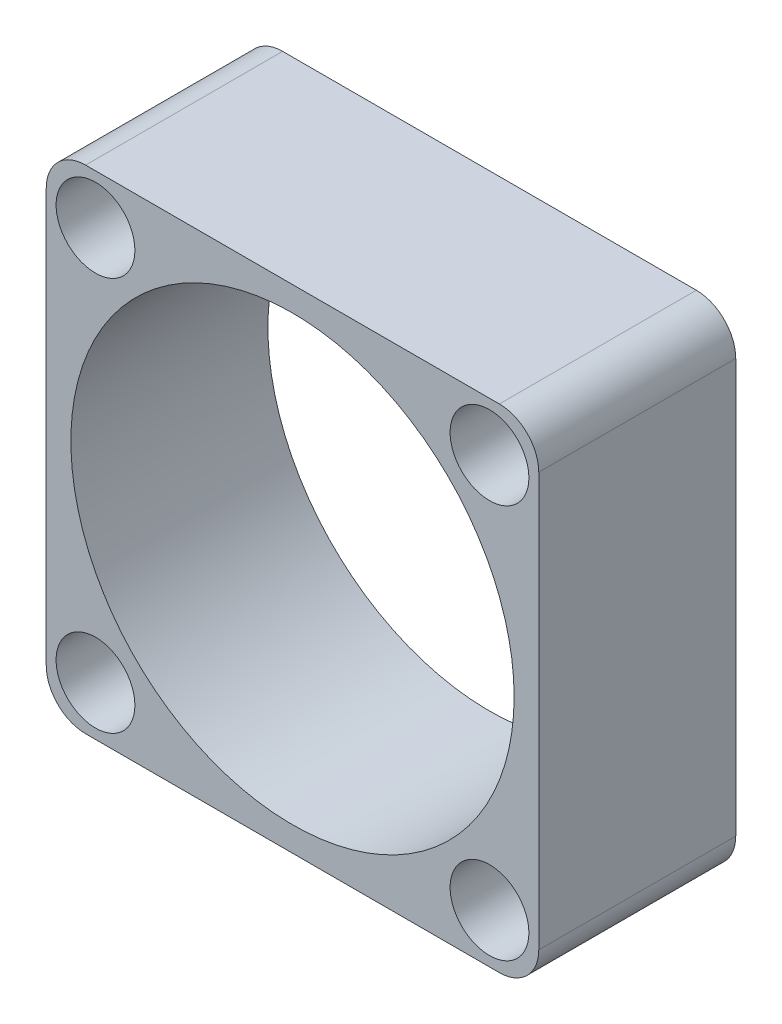
ISO-10303-21;
HEADER;
FILE_DESCRIPTION(('STEP AP214'),'2;1');
FILE_NAME('part.step','',(''),(''),'','','');
FILE_SCHEMA(('AUTOMOTIVE_DESIGN { 1 0 10303 214 1 1 1 1 }'));
ENDSEC;
DATA;
#1=APPLICATION_CONTEXT('core data for automotive mechanical design processes');
#2=APPLICATION_PROTOCOL_DEFINITION('international standard','automotive_design',2000,#1);
#3=PRODUCT_CONTEXT('',#1,'mechanical');
#4=PRODUCT('Part','Part','',(#3));
#5=PRODUCT_RELATED_PRODUCT_CATEGORY('part','',(#4));
#6=PRODUCT_DEFINITION_FORMATION('','',#4);
#7=PRODUCT_DEFINITION_CONTEXT('part definition',#1,'design');
#8=PRODUCT_DEFINITION('design','',#6,#7);
#9=PRODUCT_DEFINITION_SHAPE('','',#8);
#10=(LENGTH_UNIT() NAMED_UNIT(*) SI_UNIT(.MILLI.,.METRE.));
#11=(NAMED_UNIT(*) PLANE_ANGLE_UNIT() SI_UNIT($,.RADIAN.));
#12=(NAMED_UNIT(*) SI_UNIT($,.STERADIAN.) SOLID_ANGLE_UNIT());
#13=UNCERTAINTY_MEASURE_WITH_UNIT(LENGTH_MEASURE(1.E-05),#10,'distance_accuracy_value','');
#14=(GEOMETRIC_REPRESENTATION_CONTEXT(3) GLOBAL_UNCERTAINTY_ASSIGNED_CONTEXT((#13)) GLOBAL_UNIT_ASSIGNED_CONTEXT((#10,
#11,#12)) REPRESENTATION_CONTEXT('',''));
#15=CARTESIAN_POINT('',(0.,0.,0.));
#16=DIRECTION('',(0.,0.,1.));
#17=DIRECTION('',(1.,0.,0.));
#18=AXIS2_PLACEMENT_3D('',#15,#16,#17);
#19=CARTESIAN_POINT('',(0.,0.,10.));
#20=DIRECTION('',(1.,0.,0.));
#21=DIRECTION('',(0.,0.,-1.));
#22=AXIS2_PLACEMENT_3D('',#19,#20,#21);
#23=PLANE('',#22);
#24=DIRECTION('',(0.,-1.,0.));
#25=VECTOR('',#24,1.);
#26=CARTESIAN_POINT('',(0.,0.,0.));
#27=LINE('',#26,#25);
#28=CARTESIAN_POINT('',(0.,23.,0.));
#29=VERTEX_POINT('',#28);
#30=CARTESIAN_POINT('',(0.,2.,0.));
#31=VERTEX_POINT('',#30);
#32=EDGE_CURVE('E151',#29,#31,#27,.T.);
#33=ORIENTED_EDGE('',*,*,#32,.T.);
#34=DIRECTION('',(0.,0.,-1.));
#35=VECTOR('',#34,1.);
#36=CARTESIAN_POINT('',(0.,2.,10.));
#37=LINE('',#36,#35);
#38=CARTESIAN_POINT('',(0.,2.,10.));
#39=VERTEX_POINT('',#38);
#40=EDGE_CURVE('E129',#31,#39,#37,.F.);
#41=ORIENTED_EDGE('',*,*,#40,.T.);
#42=DIRECTION('',(0.,-1.,0.));
#43=VECTOR('',#42,1.);
#44=CARTESIAN_POINT('',(0.,0.,10.));
#45=LINE('',#44,#43);
#46=CARTESIAN_POINT('',(0.,23.,10.));
#47=VERTEX_POINT('',#46);
#48=EDGE_CURVE('E161',#47,#39,#45,.T.);
#49=ORIENTED_EDGE('',*,*,#48,.F.);
#50=DIRECTION('',(0.,0.,-1.));
#51=VECTOR('',#50,1.);
#52=CARTESIAN_POINT('',(0.,23.,10.));
#53=LINE('',#52,#51);
#54=EDGE_CURVE('E134',#47,#29,#53,.T.);
#55=ORIENTED_EDGE('',*,*,#54,.T.);
#56=EDGE_LOOP('',(#33,#41,#49,#55));
#57=FACE_BOUND('',#56,.T.);
#58=ADVANCED_FACE('F59',(#57),#23,.F.);
#59=CARTESIAN_POINT('',(0.,0.,10.));
#60=DIRECTION('',(0.,1.,0.));
#61=DIRECTION('',(0.,0.,1.));
#62=AXIS2_PLACEMENT_3D('',#59,#60,#61);
#63=PLANE('',#62);
#64=DIRECTION('',(1.,0.,0.));
#65=VECTOR('',#64,1.);
#66=CARTESIAN_POINT('',(0.,0.,10.));
#67=LINE('',#66,#65);
#68=CARTESIAN_POINT('',(2.,0.,10.));
#69=VERTEX_POINT('',#68);
#70=CARTESIAN_POINT('',(23.,0.,10.));
#71=VERTEX_POINT('',#70);
#72=EDGE_CURVE('E144',#69,#71,#67,.T.);
#73=ORIENTED_EDGE('',*,*,#72,.F.);
#74=DIRECTION('',(0.,0.,-1.));
#75=VECTOR('',#74,1.);
#76=CARTESIAN_POINT('',(2.,0.,10.));
#77=LINE('',#76,#75);
#78=CARTESIAN_POINT('',(2.,0.,0.));
#79=VERTEX_POINT('',#78);
#80=EDGE_CURVE('E128',#69,#79,#77,.T.);
#81=ORIENTED_EDGE('',*,*,#80,.T.);
#82=DIRECTION('',(1.,0.,0.));
#83=VECTOR('',#82,1.);
#84=CARTESIAN_POINT('',(0.,0.,0.));
#85=LINE('',#84,#83);
#86=CARTESIAN_POINT('',(23.,0.,0.));
#87=VERTEX_POINT('',#86);
#88=EDGE_CURVE('E141',#79,#87,#85,.T.);
#89=ORIENTED_EDGE('',*,*,#88,.T.);
#90=DIRECTION('',(0.,0.,-1.));
#91=VECTOR('',#90,1.);
#92=CARTESIAN_POINT('',(23.,0.,10.));
#93=LINE('',#92,#91);
#94=EDGE_CURVE('E146',#87,#71,#93,.F.);
#95=ORIENTED_EDGE('',*,*,#94,.T.);
#96=EDGE_LOOP('',(#73,#81,#89,#95));
#97=FACE_BOUND('',#96,.T.);
#98=ADVANCED_FACE('F140',(#97),#63,.F.);
#99=CARTESIAN_POINT('',(25.,0.,10.));
#100=DIRECTION('',(-1.,0.,0.));
#101=DIRECTION('',(0.,0.,1.));
#102=AXIS2_PLACEMENT_3D('',#99,#100,#101);
#103=PLANE('',#102);
#104=DIRECTION('',(0.,1.,0.));
#105=VECTOR('',#104,1.);
#106=CARTESIAN_POINT('',(25.,0.,10.));
#107=LINE('',#106,#105);
#108=CARTESIAN_POINT('',(25.,2.,10.));
#109=VERTEX_POINT('',#108);
#110=CARTESIAN_POINT('',(25.,23.,10.));
#111=VERTEX_POINT('',#110);
#112=EDGE_CURVE('E195',#109,#111,#107,.T.);
#113=ORIENTED_EDGE('',*,*,#112,.F.);
#114=DIRECTION('',(0.,0.,-1.));
#115=VECTOR('',#114,1.);
#116=CARTESIAN_POINT('',(25.,2.,10.));
#117=LINE('',#116,#115);
#118=CARTESIAN_POINT('',(25.,2.,0.));
#119=VERTEX_POINT('',#118);
#120=EDGE_CURVE('E180',#109,#119,#117,.T.);
#121=ORIENTED_EDGE('',*,*,#120,.T.);
#122=DIRECTION('',(0.,1.,0.));
#123=VECTOR('',#122,1.);
#124=CARTESIAN_POINT('',(25.,0.,0.));
#125=LINE('',#124,#123);
#126=CARTESIAN_POINT('',(25.,23.,0.));
#127=VERTEX_POINT('',#126);
#128=EDGE_CURVE('E150',#119,#127,#125,.T.);
#129=ORIENTED_EDGE('',*,*,#128,.T.);
#130=DIRECTION('',(0.,0.,-1.));
#131=VECTOR('',#130,1.);
#132=CARTESIAN_POINT('',(25.,23.,10.));
#133=LINE('',#132,#131);
#134=EDGE_CURVE('E178',#127,#111,#133,.F.);
#135=ORIENTED_EDGE('',*,*,#134,.T.);
#136=EDGE_LOOP('',(#113,#121,#129,#135));
#137=FACE_BOUND('',#136,.T.);
#138=ADVANCED_FACE('F212',(#137),#103,.F.);
#139=CARTESIAN_POINT('',(0.,25.,10.));
#140=DIRECTION('',(0.,-1.,0.));
#141=DIRECTION('',(0.,0.,-1.));
#142=AXIS2_PLACEMENT_3D('',#139,#140,#141);
#143=PLANE('',#142);
#144=DIRECTION('',(-1.,0.,0.));
#145=VECTOR('',#144,1.);
#146=CARTESIAN_POINT('',(0.,25.,0.));
#147=LINE('',#146,#145);
#148=CARTESIAN_POINT('',(23.,25.,0.));
#149=VERTEX_POINT('',#148);
#150=CARTESIAN_POINT('',(2.,25.,0.));
#151=VERTEX_POINT('',#150);
#152=EDGE_CURVE('E154',#149,#151,#147,.T.);
#153=ORIENTED_EDGE('',*,*,#152,.T.);
#154=DIRECTION('',(0.,0.,-1.));
#155=VECTOR('',#154,1.);
#156=CARTESIAN_POINT('',(2.,25.,10.));
#157=LINE('',#156,#155);
#158=CARTESIAN_POINT('',(2.,25.,10.));
#159=VERTEX_POINT('',#158);
#160=EDGE_CURVE('E12',#151,#159,#157,.F.);
#161=ORIENTED_EDGE('',*,*,#160,.T.);
#162=DIRECTION('',(-1.,0.,0.));
#163=VECTOR('',#162,1.);
#164=CARTESIAN_POINT('',(0.,25.,10.));
#165=LINE('',#164,#163);
#166=CARTESIAN_POINT('',(23.,25.,10.));
#167=VERTEX_POINT('',#166);
#168=EDGE_CURVE('E162',#167,#159,#165,.T.);
#169=ORIENTED_EDGE('',*,*,#168,.F.);
#170=DIRECTION('',(0.,0.,-1.));
#171=VECTOR('',#170,1.);
#172=CARTESIAN_POINT('',(23.,25.,10.));
#173=LINE('',#172,#171);
#174=EDGE_CURVE('E67',#167,#149,#173,.T.);
#175=ORIENTED_EDGE('',*,*,#174,.T.);
#176=EDGE_LOOP('',(#153,#161,#169,#175));
#177=FACE_BOUND('',#176,.T.);
#178=ADVANCED_FACE('F185',(#177),#143,.F.);
#179=CARTESIAN_POINT('',(0.,0.,10.));
#180=DIRECTION('',(0.,0.,-1.));
#181=DIRECTION('',(-1.,0.,0.));
#182=AXIS2_PLACEMENT_3D('',#179,#180,#181);
#183=PLANE('',#182);
#184=CARTESIAN_POINT('',(22.5,22.5,10.));
#185=DIRECTION('',(0.,0.,1.));
#186=DIRECTION('',(1.,0.,0.));
#187=AXIS2_PLACEMENT_3D('',#184,#185,#186);
#188=CIRCLE('',#187,2.);
#189=CARTESIAN_POINT('',(24.5,22.5,10.));
#190=VERTEX_POINT('',#189);
#191=EDGE_CURVE('E360',#190,#190,#188,.T.);
#192=ORIENTED_EDGE('',*,*,#191,.F.);
#193=EDGE_LOOP('',(#192));
#194=FACE_BOUND('',#193,.T.);
#195=CARTESIAN_POINT('',(22.5,2.5,10.));
#196=DIRECTION('',(0.,0.,1.));
#197=DIRECTION('',(1.,0.,0.));
#198=AXIS2_PLACEMENT_3D('',#195,#196,#197);
#199=CIRCLE('',#198,2.);
#200=CARTESIAN_POINT('',(24.5,2.5,10.));
#201=VERTEX_POINT('',#200);
#202=EDGE_CURVE('E354',#201,#201,#199,.T.);
#203=ORIENTED_EDGE('',*,*,#202,.F.);
#204=EDGE_LOOP('',(#203));
#205=FACE_BOUND('',#204,.T.);
#206=CARTESIAN_POINT('',(2.5,2.5,10.));
#207=DIRECTION('',(0.,0.,1.));
#208=DIRECTION('',(1.,0.,0.));
#209=AXIS2_PLACEMENT_3D('',#206,#207,#208);
#210=CIRCLE('',#209,2.);
#211=CARTESIAN_POINT('',(4.5,2.5,10.));
#212=VERTEX_POINT('',#211);
#213=EDGE_CURVE('E348',#212,#212,#210,.T.);
#214=ORIENTED_EDGE('',*,*,#213,.F.);
#215=EDGE_LOOP('',(#214));
#216=FACE_BOUND('',#215,.T.);
#217=CARTESIAN_POINT('',(2.5,22.5,10.));
#218=DIRECTION('',(0.,0.,1.));
#219=DIRECTION('',(1.,0.,0.));
#220=AXIS2_PLACEMENT_3D('',#217,#218,#219);
#221=CIRCLE('',#220,2.);
#222=CARTESIAN_POINT('',(4.5,22.5,10.));
#223=VERTEX_POINT('',#222);
#224=EDGE_CURVE('E340',#223,#223,#221,.T.);
#225=ORIENTED_EDGE('',*,*,#224,.F.);
#226=EDGE_LOOP('',(#225));
#227=FACE_BOUND('',#226,.T.);
#228=CARTESIAN_POINT('',(12.5,12.5,10.));
#229=DIRECTION('',(0.,0.,1.));
#230=DIRECTION('',(1.,0.,0.));
#231=AXIS2_PLACEMENT_3D('',#228,#229,#230);
#232=CIRCLE('',#231,11.25);
#233=CARTESIAN_POINT('',(23.75,12.5,10.));
#234=VERTEX_POINT('',#233);
#235=EDGE_CURVE('E198',#234,#234,#232,.T.);
#236=ORIENTED_EDGE('',*,*,#235,.F.);
#237=EDGE_LOOP('',(#236));
#238=FACE_BOUND('',#237,.T.);
#239=ORIENTED_EDGE('',*,*,#48,.T.);
#240=CARTESIAN_POINT('',(2.,2.,10.));
#241=DIRECTION('',(0.,0.,-1.));
#242=DIRECTION('',(-1.,0.,0.));
#243=AXIS2_PLACEMENT_3D('',#240,#241,#242);
#244=CIRCLE('',#243,2.);
#245=EDGE_CURVE('E176',#39,#69,#244,.F.);
#246=ORIENTED_EDGE('',*,*,#245,.T.);
#247=ORIENTED_EDGE('',*,*,#72,.T.);
#248=CARTESIAN_POINT('',(23.,2.,10.));
#249=DIRECTION('',(0.,0.,-1.));
#250=DIRECTION('',(-1.,0.,0.));
#251=AXIS2_PLACEMENT_3D('',#248,#249,#250);
#252=CIRCLE('',#251,2.);
#253=EDGE_CURVE('E174',#71,#109,#252,.F.);
#254=ORIENTED_EDGE('',*,*,#253,.T.);
#255=ORIENTED_EDGE('',*,*,#112,.T.);
#256=CARTESIAN_POINT('',(23.,23.,10.));
#257=DIRECTION('',(0.,0.,-1.));
#258=DIRECTION('',(-1.,0.,0.));
#259=AXIS2_PLACEMENT_3D('',#256,#257,#258);
#260=CIRCLE('',#259,2.);
#261=EDGE_CURVE('E79',#111,#167,#260,.F.);
#262=ORIENTED_EDGE('',*,*,#261,.T.);
#263=ORIENTED_EDGE('',*,*,#168,.T.);
#264=CARTESIAN_POINT('',(2.,23.,10.));
#265=DIRECTION('',(0.,0.,-1.));
#266=DIRECTION('',(-1.,0.,0.));
#267=AXIS2_PLACEMENT_3D('',#264,#265,#266);
#268=CIRCLE('',#267,2.);
#269=EDGE_CURVE('E172',#159,#47,#268,.F.);
#270=ORIENTED_EDGE('',*,*,#269,.T.);
#271=EDGE_LOOP('',(#239,#246,#247,#254,#255,#262,#263,#270));
#272=FACE_BOUND('',#271,.T.);
#273=ADVANCED_FACE('F201',(#194,#205,#216,#227,#238,#272),#183,.F.);
#274=CARTESIAN_POINT('',(0.,0.,0.));
#275=DIRECTION('',(0.,0.,-1.));
#276=DIRECTION('',(-1.,0.,0.));
#277=AXIS2_PLACEMENT_3D('',#274,#275,#276);
#278=PLANE('',#277);
#279=CARTESIAN_POINT('',(22.5,22.5,0.));
#280=DIRECTION('',(0.,0.,1.));
#281=DIRECTION('',(1.,0.,0.));
#282=AXIS2_PLACEMENT_3D('',#279,#280,#281);
#283=CIRCLE('',#282,2.);
#284=CARTESIAN_POINT('',(24.5,22.5,0.));
#285=VERTEX_POINT('',#284);
#286=EDGE_CURVE('E357',#285,#285,#283,.T.);
#287=ORIENTED_EDGE('',*,*,#286,.T.);
#288=EDGE_LOOP('',(#287));
#289=FACE_BOUND('',#288,.T.);
#290=CARTESIAN_POINT('',(22.5,2.5,0.));
#291=DIRECTION('',(0.,0.,1.));
#292=DIRECTION('',(1.,0.,0.));
#293=AXIS2_PLACEMENT_3D('',#290,#291,#292);
#294=CIRCLE('',#293,2.);
#295=CARTESIAN_POINT('',(24.5,2.5,0.));
#296=VERTEX_POINT('',#295);
#297=EDGE_CURVE('E351',#296,#296,#294,.T.);
#298=ORIENTED_EDGE('',*,*,#297,.T.);
#299=EDGE_LOOP('',(#298));
#300=FACE_BOUND('',#299,.T.);
#301=CARTESIAN_POINT('',(2.5,2.5,0.));
#302=DIRECTION('',(0.,0.,1.));
#303=DIRECTION('',(1.,0.,0.));
#304=AXIS2_PLACEMENT_3D('',#301,#302,#303);
#305=CIRCLE('',#304,2.);
#306=CARTESIAN_POINT('',(4.5,2.5,0.));
#307=VERTEX_POINT('',#306);
#308=EDGE_CURVE('E345',#307,#307,#305,.T.);
#309=ORIENTED_EDGE('',*,*,#308,.T.);
#310=EDGE_LOOP('',(#309));
#311=FACE_BOUND('',#310,.T.);
#312=CARTESIAN_POINT('',(2.5,22.5,0.));
#313=DIRECTION('',(0.,0.,1.));
#314=DIRECTION('',(1.,0.,0.));
#315=AXIS2_PLACEMENT_3D('',#312,#313,#314);
#316=CIRCLE('',#315,2.);
#317=CARTESIAN_POINT('',(4.5,22.5,0.));
#318=VERTEX_POINT('',#317);
#319=EDGE_CURVE('E338',#318,#318,#316,.T.);
#320=ORIENTED_EDGE('',*,*,#319,.T.);
#321=EDGE_LOOP('',(#320));
#322=FACE_BOUND('',#321,.T.);
#323=CARTESIAN_POINT('',(12.5,12.5,0.));
#324=DIRECTION('',(0.,0.,1.));
#325=DIRECTION('',(1.,0.,0.));
#326=AXIS2_PLACEMENT_3D('',#323,#324,#325);
#327=CIRCLE('',#326,11.25);
#328=CARTESIAN_POINT('',(23.75,12.5,0.));
#329=VERTEX_POINT('',#328);
#330=EDGE_CURVE('E156',#329,#329,#327,.T.);
#331=ORIENTED_EDGE('',*,*,#330,.T.);
#332=EDGE_LOOP('',(#331));
#333=FACE_BOUND('',#332,.T.);
#334=ORIENTED_EDGE('',*,*,#88,.F.);
#335=CARTESIAN_POINT('',(2.,2.,0.));
#336=DIRECTION('',(0.,0.,-1.));
#337=DIRECTION('',(-1.,0.,0.));
#338=AXIS2_PLACEMENT_3D('',#335,#336,#337);
#339=CIRCLE('',#338,2.);
#340=EDGE_CURVE('E124',#79,#31,#339,.T.);
#341=ORIENTED_EDGE('',*,*,#340,.T.);
#342=ORIENTED_EDGE('',*,*,#32,.F.);
#343=CARTESIAN_POINT('',(2.,23.,0.));
#344=DIRECTION('',(0.,0.,-1.));
#345=DIRECTION('',(-1.,0.,0.));
#346=AXIS2_PLACEMENT_3D('',#343,#344,#345);
#347=CIRCLE('',#346,2.);
#348=EDGE_CURVE('E165',#29,#151,#347,.T.);
#349=ORIENTED_EDGE('',*,*,#348,.T.);
#350=ORIENTED_EDGE('',*,*,#152,.F.);
#351=CARTESIAN_POINT('',(23.,23.,0.));
#352=DIRECTION('',(0.,0.,-1.));
#353=DIRECTION('',(-1.,0.,0.));
#354=AXIS2_PLACEMENT_3D('',#351,#352,#353);
#355=CIRCLE('',#354,2.);
#356=EDGE_CURVE('E145',#149,#127,#355,.T.);
#357=ORIENTED_EDGE('',*,*,#356,.T.);
#358=ORIENTED_EDGE('',*,*,#128,.F.);
#359=CARTESIAN_POINT('',(23.,2.,0.));
#360=DIRECTION('',(0.,0.,-1.));
#361=DIRECTION('',(-1.,0.,0.));
#362=AXIS2_PLACEMENT_3D('',#359,#360,#361);
#363=CIRCLE('',#362,2.);
#364=EDGE_CURVE('E135',#119,#87,#363,.T.);
#365=ORIENTED_EDGE('',*,*,#364,.T.);
#366=EDGE_LOOP('',(#334,#341,#342,#349,#350,#357,#358,#365));
#367=FACE_BOUND('',#366,.T.);
#368=ADVANCED_FACE('F148',(#289,#300,#311,#322,#333,#367),#278,.T.);
#369=CARTESIAN_POINT('',(12.5,12.5,0.));
#370=DIRECTION('',(0.,0.,1.));
#371=DIRECTION('',(1.,0.,0.));
#372=AXIS2_PLACEMENT_3D('',#369,#370,#371);
#373=CYLINDRICAL_SURFACE('',#372,11.25);
#374=ORIENTED_EDGE('',*,*,#330,.F.);
#375=EDGE_LOOP('',(#374));
#376=FACE_BOUND('',#375,.T.);
#377=ORIENTED_EDGE('',*,*,#235,.T.);
#378=EDGE_LOOP('',(#377));
#379=FACE_BOUND('',#378,.T.);
#380=ADVANCED_FACE('F209',(#376,#379),#373,.F.);
#381=CARTESIAN_POINT('',(2.5,22.5,0.));
#382=DIRECTION('',(0.,0.,1.));
#383=DIRECTION('',(1.,0.,0.));
#384=AXIS2_PLACEMENT_3D('',#381,#382,#383);
#385=CYLINDRICAL_SURFACE('',#384,2.);
#386=ORIENTED_EDGE('',*,*,#319,.F.);
#387=EDGE_LOOP('',(#386));
#388=FACE_BOUND('',#387,.T.);
#389=ORIENTED_EDGE('',*,*,#224,.T.);
#390=EDGE_LOOP('',(#389));
#391=FACE_BOUND('',#390,.T.);
#392=ADVANCED_FACE('F307',(#388,#391),#385,.F.);
#393=CARTESIAN_POINT('',(2.5,2.5,0.));
#394=DIRECTION('',(0.,0.,1.));
#395=DIRECTION('',(1.,0.,0.));
#396=AXIS2_PLACEMENT_3D('',#393,#394,#395);
#397=CYLINDRICAL_SURFACE('',#396,2.);
#398=ORIENTED_EDGE('',*,*,#308,.F.);
#399=EDGE_LOOP('',(#398));
#400=FACE_BOUND('',#399,.T.);
#401=ORIENTED_EDGE('',*,*,#213,.T.);
#402=EDGE_LOOP('',(#401));
#403=FACE_BOUND('',#402,.T.);
#404=ADVANCED_FACE('F299',(#400,#403),#397,.F.);
#405=CARTESIAN_POINT('',(22.5,2.5,0.));
#406=DIRECTION('',(0.,0.,1.));
#407=DIRECTION('',(1.,0.,0.));
#408=AXIS2_PLACEMENT_3D('',#405,#406,#407);
#409=CYLINDRICAL_SURFACE('',#408,2.);
#410=ORIENTED_EDGE('',*,*,#297,.F.);
#411=EDGE_LOOP('',(#410));
#412=FACE_BOUND('',#411,.T.);
#413=ORIENTED_EDGE('',*,*,#202,.T.);
#414=EDGE_LOOP('',(#413));
#415=FACE_BOUND('',#414,.T.);
#416=ADVANCED_FACE('F292',(#412,#415),#409,.F.);
#417=CARTESIAN_POINT('',(22.5,22.5,0.));
#418=DIRECTION('',(0.,0.,1.));
#419=DIRECTION('',(1.,0.,0.));
#420=AXIS2_PLACEMENT_3D('',#417,#418,#419);
#421=CYLINDRICAL_SURFACE('',#420,2.);
#422=ORIENTED_EDGE('',*,*,#286,.F.);
#423=EDGE_LOOP('',(#422));
#424=FACE_BOUND('',#423,.T.);
#425=ORIENTED_EDGE('',*,*,#191,.T.);
#426=EDGE_LOOP('',(#425));
#427=FACE_BOUND('',#426,.T.);
#428=ADVANCED_FACE('F228',(#424,#427),#421,.F.);
#429=CARTESIAN_POINT('',(2.,2.,10.));
#430=DIRECTION('',(0.,0.,-1.));
#431=DIRECTION('',(-1.,0.,0.));
#432=AXIS2_PLACEMENT_3D('',#429,#430,#431);
#433=CYLINDRICAL_SURFACE('',#432,2.);
#434=ORIENTED_EDGE('',*,*,#245,.F.);
#435=ORIENTED_EDGE('',*,*,#40,.F.);
#436=ORIENTED_EDGE('',*,*,#340,.F.);
#437=ORIENTED_EDGE('',*,*,#80,.F.);
#438=EDGE_LOOP('',(#434,#435,#436,#437));
#439=FACE_BOUND('',#438,.T.);
#440=ADVANCED_FACE('F127',(#439),#433,.T.);
#441=CARTESIAN_POINT('',(23.,2.,10.));
#442=DIRECTION('',(0.,0.,-1.));
#443=DIRECTION('',(-1.,0.,0.));
#444=AXIS2_PLACEMENT_3D('',#441,#442,#443);
#445=CYLINDRICAL_SURFACE('',#444,2.);
#446=ORIENTED_EDGE('',*,*,#253,.F.);
#447=ORIENTED_EDGE('',*,*,#94,.F.);
#448=ORIENTED_EDGE('',*,*,#364,.F.);
#449=ORIENTED_EDGE('',*,*,#120,.F.);
#450=EDGE_LOOP('',(#446,#447,#448,#449));
#451=FACE_BOUND('',#450,.T.);
#452=ADVANCED_FACE('F227',(#451),#445,.T.);
#453=CARTESIAN_POINT('',(2.,23.,10.));
#454=DIRECTION('',(0.,0.,-1.));
#455=DIRECTION('',(-1.,0.,0.));
#456=AXIS2_PLACEMENT_3D('',#453,#454,#455);
#457=CYLINDRICAL_SURFACE('',#456,2.);
#458=ORIENTED_EDGE('',*,*,#269,.F.);
#459=ORIENTED_EDGE('',*,*,#160,.F.);
#460=ORIENTED_EDGE('',*,*,#348,.F.);
#461=ORIENTED_EDGE('',*,*,#54,.F.);
#462=EDGE_LOOP('',(#458,#459,#460,#461));
#463=FACE_BOUND('',#462,.T.);
#464=ADVANCED_FACE('F190',(#463),#457,.T.);
#465=CARTESIAN_POINT('',(23.,23.,10.));
#466=DIRECTION('',(0.,0.,-1.));
#467=DIRECTION('',(-1.,0.,0.));
#468=AXIS2_PLACEMENT_3D('',#465,#466,#467);
#469=CYLINDRICAL_SURFACE('',#468,2.);
#470=ORIENTED_EDGE('',*,*,#261,.F.);
#471=ORIENTED_EDGE('',*,*,#134,.F.);
#472=ORIENTED_EDGE('',*,*,#356,.F.);
#473=ORIENTED_EDGE('',*,*,#174,.F.);
#474=EDGE_LOOP('',(#470,#471,#472,#473));
#475=FACE_BOUND('',#474,.T.);
#476=ADVANCED_FACE('F61',(#475),#469,.T.);
#477=CLOSED_SHELL('',(#58,#98,#138,#178,#273,#368,#380,#392,#404,#416,#428,#440,#452,#464,#476));
#478=MANIFOLD_SOLID_BREP('B2',#477);
#479=ADVANCED_BREP_SHAPE_REPRESENTATION('',(#18,#478),#14);
#480=SHAPE_DEFINITION_REPRESENTATION(#9,#479);
ENDSEC;
END-ISO-10303-21;
